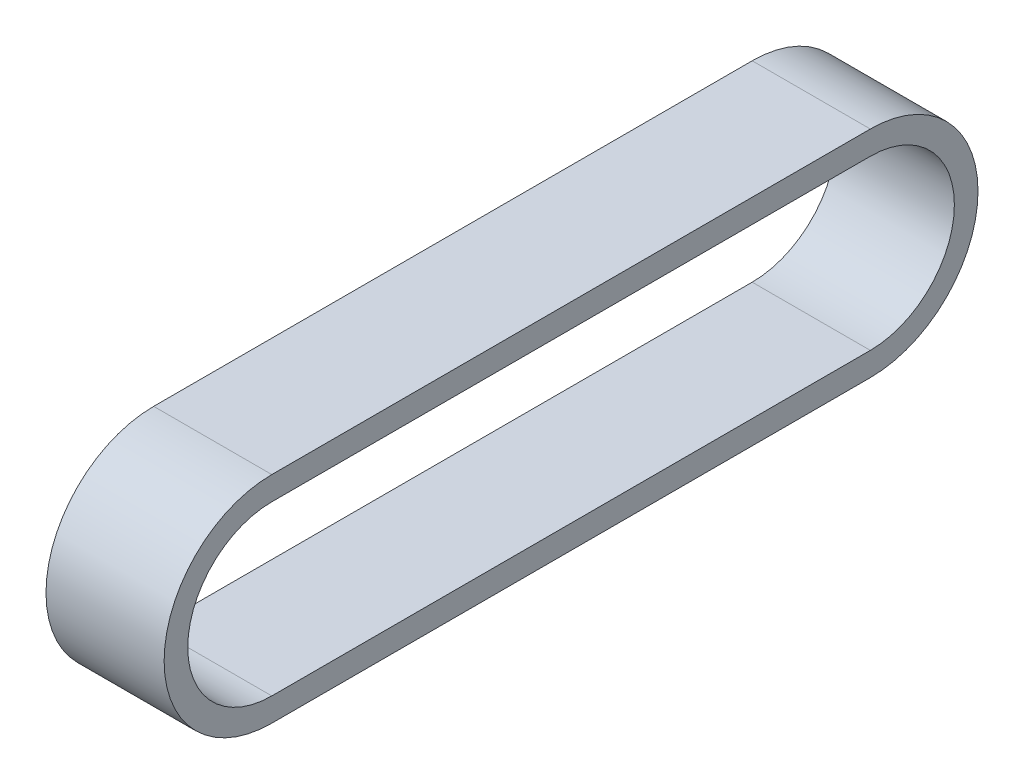
ISO-10303-21;
HEADER;
FILE_DESCRIPTION(('STEP AP214'),'2;1');
FILE_NAME('part.step','',(''),(''),'','','');
FILE_SCHEMA(('AUTOMOTIVE_DESIGN { 1 0 10303 214 1 1 1 1 }'));
ENDSEC;
DATA;
#1=APPLICATION_CONTEXT('core data for automotive mechanical design processes');
#2=APPLICATION_PROTOCOL_DEFINITION('international standard','automotive_design',2000,#1);
#3=PRODUCT_CONTEXT('',#1,'mechanical');
#4=PRODUCT('Part','Part','',(#3));
#5=PRODUCT_RELATED_PRODUCT_CATEGORY('part','',(#4));
#6=PRODUCT_DEFINITION_FORMATION('','',#4);
#7=PRODUCT_DEFINITION_CONTEXT('part definition',#1,'design');
#8=PRODUCT_DEFINITION('design','',#6,#7);
#9=PRODUCT_DEFINITION_SHAPE('','',#8);
#10=(LENGTH_UNIT() NAMED_UNIT(*) SI_UNIT(.MILLI.,.METRE.));
#11=(NAMED_UNIT(*) PLANE_ANGLE_UNIT() SI_UNIT($,.RADIAN.));
#12=(NAMED_UNIT(*) SI_UNIT($,.STERADIAN.) SOLID_ANGLE_UNIT());
#13=UNCERTAINTY_MEASURE_WITH_UNIT(LENGTH_MEASURE(1.E-05),#10,'distance_accuracy_value','');
#14=(GEOMETRIC_REPRESENTATION_CONTEXT(3) GLOBAL_UNCERTAINTY_ASSIGNED_CONTEXT((#13)) GLOBAL_UNIT_ASSIGNED_CONTEXT((#10,
#11,#12)) REPRESENTATION_CONTEXT('',''));
#15=CARTESIAN_POINT('',(0.,0.,0.));
#16=DIRECTION('',(0.,0.,1.));
#17=DIRECTION('',(1.,0.,0.));
#18=AXIS2_PLACEMENT_3D('',#15,#16,#17);
#19=CARTESIAN_POINT('',(-15.,0.,75.9999999999967));
#20=DIRECTION('',(1.,0.,0.));
#21=DIRECTION('',(0.,0.,-1.));
#22=AXIS2_PLACEMENT_3D('',#19,#20,#21);
#23=CYLINDRICAL_SURFACE('',#22,27.345);
#24=DIRECTION('',(1.,0.,0.));
#25=VECTOR('',#24,1.);
#26=CARTESIAN_POINT('',(-15.,-27.345,76.));
#27=LINE('',#26,#25);
#28=CARTESIAN_POINT('',(-15.,-27.345,76.));
#29=VERTEX_POINT('',#28);
#30=CARTESIAN_POINT('',(15.,-27.345,76.));
#31=VERTEX_POINT('',#30);
#32=EDGE_CURVE('E35',#29,#31,#27,.T.);
#33=ORIENTED_EDGE('',*,*,#32,.T.);
#34=CARTESIAN_POINT('',(15.,0.,75.9999999999967));
#35=DIRECTION('',(1.,0.,0.));
#36=DIRECTION('',(0.,0.,-1.));
#37=AXIS2_PLACEMENT_3D('',#34,#35,#36);
#38=CIRCLE('',#37,27.345);
#39=CARTESIAN_POINT('',(15.,27.345,76.));
#40=VERTEX_POINT('',#39);
#41=EDGE_CURVE('E130',#40,#31,#38,.T.);
#42=ORIENTED_EDGE('',*,*,#41,.F.);
#43=DIRECTION('',(1.,0.,0.));
#44=VECTOR('',#43,1.);
#45=CARTESIAN_POINT('',(-15.,27.345,76.));
#46=LINE('',#45,#44);
#47=CARTESIAN_POINT('',(-15.,27.345,76.));
#48=VERTEX_POINT('',#47);
#49=EDGE_CURVE('E11',#48,#40,#46,.T.);
#50=ORIENTED_EDGE('',*,*,#49,.F.);
#51=CARTESIAN_POINT('',(-15.,0.,75.9999999999967));
#52=DIRECTION('',(1.,0.,0.));
#53=DIRECTION('',(0.,0.,-1.));
#54=AXIS2_PLACEMENT_3D('',#51,#52,#53);
#55=CIRCLE('',#54,27.345);
#56=EDGE_CURVE('E145',#48,#29,#55,.T.);
#57=ORIENTED_EDGE('',*,*,#56,.T.);
#58=EDGE_LOOP('',(#33,#42,#50,#57));
#59=FACE_BOUND('',#58,.T.);
#60=ADVANCED_FACE('F32',(#59),#23,.T.);
#61=CARTESIAN_POINT('',(-15.,27.345,76.));
#62=DIRECTION('',(0.,1.,0.));
#63=DIRECTION('',(0.,0.,1.));
#64=AXIS2_PLACEMENT_3D('',#61,#62,#63);
#65=PLANE('',#64);
#66=ORIENTED_EDGE('',*,*,#49,.T.);
#67=DIRECTION('',(0.,0.,1.));
#68=VECTOR('',#67,1.);
#69=CARTESIAN_POINT('',(15.,27.345,76.));
#70=LINE('',#69,#68);
#71=CARTESIAN_POINT('',(15.,27.345,-76.));
#72=VERTEX_POINT('',#71);
#73=EDGE_CURVE('E142',#72,#40,#70,.T.);
#74=ORIENTED_EDGE('',*,*,#73,.F.);
#75=DIRECTION('',(1.,0.,0.));
#76=VECTOR('',#75,1.);
#77=CARTESIAN_POINT('',(-15.,27.345,-76.));
#78=LINE('',#77,#76);
#79=CARTESIAN_POINT('',(-15.,27.345,-76.));
#80=VERTEX_POINT('',#79);
#81=EDGE_CURVE('E40',#80,#72,#78,.T.);
#82=ORIENTED_EDGE('',*,*,#81,.F.);
#83=DIRECTION('',(0.,0.,1.));
#84=VECTOR('',#83,1.);
#85=CARTESIAN_POINT('',(-15.,27.345,76.));
#86=LINE('',#85,#84);
#87=EDGE_CURVE('E154',#80,#48,#86,.T.);
#88=ORIENTED_EDGE('',*,*,#87,.T.);
#89=EDGE_LOOP('',(#66,#74,#82,#88));
#90=FACE_BOUND('',#89,.T.);
#91=ADVANCED_FACE('F170',(#90),#65,.T.);
#92=CARTESIAN_POINT('',(-15.,0.,-75.9999999999967));
#93=DIRECTION('',(1.,0.,0.));
#94=DIRECTION('',(0.,0.,-1.));
#95=AXIS2_PLACEMENT_3D('',#92,#93,#94);
#96=CYLINDRICAL_SURFACE('',#95,27.345);
#97=ORIENTED_EDGE('',*,*,#81,.T.);
#98=CARTESIAN_POINT('',(15.,0.,-75.9999999999967));
#99=DIRECTION('',(1.,0.,0.));
#100=DIRECTION('',(0.,0.,-1.));
#101=AXIS2_PLACEMENT_3D('',#98,#99,#100);
#102=CIRCLE('',#101,27.345);
#103=CARTESIAN_POINT('',(15.,-27.345,-76.));
#104=VERTEX_POINT('',#103);
#105=EDGE_CURVE('E139',#104,#72,#102,.T.);
#106=ORIENTED_EDGE('',*,*,#105,.F.);
#107=DIRECTION('',(1.,0.,0.));
#108=VECTOR('',#107,1.);
#109=CARTESIAN_POINT('',(-15.,-27.345,-76.));
#110=LINE('',#109,#108);
#111=CARTESIAN_POINT('',(-15.,-27.345,-76.));
#112=VERTEX_POINT('',#111);
#113=EDGE_CURVE('E157',#112,#104,#110,.T.);
#114=ORIENTED_EDGE('',*,*,#113,.F.);
#115=CARTESIAN_POINT('',(-15.,0.,-75.9999999999967));
#116=DIRECTION('',(1.,0.,0.));
#117=DIRECTION('',(0.,0.,-1.));
#118=AXIS2_PLACEMENT_3D('',#115,#116,#117);
#119=CIRCLE('',#118,27.345);
#120=EDGE_CURVE('E151',#112,#80,#119,.T.);
#121=ORIENTED_EDGE('',*,*,#120,.T.);
#122=EDGE_LOOP('',(#97,#106,#114,#121));
#123=FACE_BOUND('',#122,.T.);
#124=ADVANCED_FACE('F174',(#123),#96,.T.);
#125=CARTESIAN_POINT('',(-15.,-27.345,76.));
#126=DIRECTION('',(0.,-1.,0.));
#127=DIRECTION('',(0.,0.,-1.));
#128=AXIS2_PLACEMENT_3D('',#125,#126,#127);
#129=PLANE('',#128);
#130=ORIENTED_EDGE('',*,*,#113,.T.);
#131=DIRECTION('',(0.,0.,-1.));
#132=VECTOR('',#131,1.);
#133=CARTESIAN_POINT('',(15.,-27.345,76.));
#134=LINE('',#133,#132);
#135=EDGE_CURVE('E136',#31,#104,#134,.T.);
#136=ORIENTED_EDGE('',*,*,#135,.F.);
#137=ORIENTED_EDGE('',*,*,#32,.F.);
#138=DIRECTION('',(0.,0.,-1.));
#139=VECTOR('',#138,1.);
#140=CARTESIAN_POINT('',(-15.,-27.345,76.));
#141=LINE('',#140,#139);
#142=EDGE_CURVE('E148',#29,#112,#141,.T.);
#143=ORIENTED_EDGE('',*,*,#142,.T.);
#144=EDGE_LOOP('',(#130,#136,#137,#143));
#145=FACE_BOUND('',#144,.T.);
#146=ADVANCED_FACE('F164',(#145),#129,.T.);
#147=CARTESIAN_POINT('',(-15.,0.,75.9999999999967));
#148=DIRECTION('',(1.,0.,0.));
#149=DIRECTION('',(0.,0.,-1.));
#150=AXIS2_PLACEMENT_3D('',#147,#148,#149);
#151=PLANE('',#150);
#152=DIRECTION('',(0.,0.,1.));
#153=VECTOR('',#152,1.);
#154=CARTESIAN_POINT('',(-15.,21.345,75.9999999999951));
#155=LINE('',#154,#153);
#156=CARTESIAN_POINT('',(-15.,21.3450000000002,-75.9999999999951));
#157=VERTEX_POINT('',#156);
#158=CARTESIAN_POINT('',(-15.,21.345,75.9999999999951));
#159=VERTEX_POINT('',#158);
#160=EDGE_CURVE('E105',#157,#159,#155,.T.);
#161=ORIENTED_EDGE('',*,*,#160,.T.);
#162=CARTESIAN_POINT('',(-15.,0.,75.9999999999951));
#163=DIRECTION('',(1.,0.,0.));
#164=DIRECTION('',(0.,0.,-1.));
#165=AXIS2_PLACEMENT_3D('',#162,#163,#164);
#166=CIRCLE('',#165,21.345);
#167=CARTESIAN_POINT('',(-15.,-21.345,75.9999999999951));
#168=VERTEX_POINT('',#167);
#169=EDGE_CURVE('E99',#159,#168,#166,.T.);
#170=ORIENTED_EDGE('',*,*,#169,.T.);
#171=DIRECTION('',(0.,0.,-1.));
#172=VECTOR('',#171,1.);
#173=CARTESIAN_POINT('',(-15.,-21.345,75.9999999999951));
#174=LINE('',#173,#172);
#175=CARTESIAN_POINT('',(-15.,-21.3450000000002,-75.999999999995));
#176=VERTEX_POINT('',#175);
#177=EDGE_CURVE('E108',#168,#176,#174,.T.);
#178=ORIENTED_EDGE('',*,*,#177,.T.);
#179=CARTESIAN_POINT('',(-15.,0.,-75.9999999999951));
#180=DIRECTION('',(1.,0.,0.));
#181=DIRECTION('',(0.,0.,-1.));
#182=AXIS2_PLACEMENT_3D('',#179,#180,#181);
#183=CIRCLE('',#182,21.3450000000002);
#184=EDGE_CURVE('E48',#176,#157,#183,.T.);
#185=ORIENTED_EDGE('',*,*,#184,.T.);
#186=EDGE_LOOP('',(#161,#170,#178,#185));
#187=FACE_BOUND('',#186,.T.);
#188=ORIENTED_EDGE('',*,*,#56,.F.);
#189=ORIENTED_EDGE('',*,*,#87,.F.);
#190=ORIENTED_EDGE('',*,*,#120,.F.);
#191=ORIENTED_EDGE('',*,*,#142,.F.);
#192=EDGE_LOOP('',(#188,#189,#190,#191));
#193=FACE_BOUND('',#192,.T.);
#194=ADVANCED_FACE('F112',(#187,#193),#151,.F.);
#195=CARTESIAN_POINT('',(15.,0.,75.9999999999967));
#196=DIRECTION('',(1.,0.,0.));
#197=DIRECTION('',(0.,0.,-1.));
#198=AXIS2_PLACEMENT_3D('',#195,#196,#197);
#199=PLANE('',#198);
#200=CARTESIAN_POINT('',(15.,0.,75.9999999999951));
#201=DIRECTION('',(1.,0.,0.));
#202=DIRECTION('',(0.,0.,-1.));
#203=AXIS2_PLACEMENT_3D('',#200,#201,#202);
#204=CIRCLE('',#203,21.345);
#205=CARTESIAN_POINT('',(15.,21.345,75.9999999999951));
#206=VERTEX_POINT('',#205);
#207=CARTESIAN_POINT('',(15.,-21.345,75.9999999999951));
#208=VERTEX_POINT('',#207);
#209=EDGE_CURVE('E56',#206,#208,#204,.T.);
#210=ORIENTED_EDGE('',*,*,#209,.F.);
#211=DIRECTION('',(0.,0.,1.));
#212=VECTOR('',#211,1.);
#213=CARTESIAN_POINT('',(15.,21.345,75.9999999999951));
#214=LINE('',#213,#212);
#215=CARTESIAN_POINT('',(15.,21.3450000000002,-75.9999999999951));
#216=VERTEX_POINT('',#215);
#217=EDGE_CURVE('E115',#216,#206,#214,.T.);
#218=ORIENTED_EDGE('',*,*,#217,.F.);
#219=CARTESIAN_POINT('',(15.,0.,-75.9999999999951));
#220=DIRECTION('',(1.,0.,0.));
#221=DIRECTION('',(0.,0.,-1.));
#222=AXIS2_PLACEMENT_3D('',#219,#220,#221);
#223=CIRCLE('',#222,21.3450000000002);
#224=CARTESIAN_POINT('',(15.,-21.3450000000002,-75.9999999999951));
#225=VERTEX_POINT('',#224);
#226=EDGE_CURVE('E118',#225,#216,#223,.T.);
#227=ORIENTED_EDGE('',*,*,#226,.F.);
#228=DIRECTION('',(0.,0.,-1.));
#229=VECTOR('',#228,1.);
#230=CARTESIAN_POINT('',(15.,-21.345,75.9999999999951));
#231=LINE('',#230,#229);
#232=EDGE_CURVE('E124',#208,#225,#231,.T.);
#233=ORIENTED_EDGE('',*,*,#232,.F.);
#234=EDGE_LOOP('',(#210,#218,#227,#233));
#235=FACE_BOUND('',#234,.T.);
#236=ORIENTED_EDGE('',*,*,#41,.T.);
#237=ORIENTED_EDGE('',*,*,#135,.T.);
#238=ORIENTED_EDGE('',*,*,#105,.T.);
#239=ORIENTED_EDGE('',*,*,#73,.T.);
#240=EDGE_LOOP('',(#236,#237,#238,#239));
#241=FACE_BOUND('',#240,.T.);
#242=ADVANCED_FACE('F167',(#235,#241),#199,.T.);
#243=CARTESIAN_POINT('',(-15.,0.,75.9999999999951));
#244=DIRECTION('',(1.,0.,0.));
#245=DIRECTION('',(0.,0.,-1.));
#246=AXIS2_PLACEMENT_3D('',#243,#244,#245);
#247=CYLINDRICAL_SURFACE('',#246,21.345);
#248=ORIENTED_EDGE('',*,*,#209,.T.);
#249=DIRECTION('',(1.,0.,0.));
#250=VECTOR('',#249,1.);
#251=CARTESIAN_POINT('',(-15.,-21.345,75.9999999999951));
#252=LINE('',#251,#250);
#253=EDGE_CURVE('E95',#168,#208,#252,.T.);
#254=ORIENTED_EDGE('',*,*,#253,.F.);
#255=ORIENTED_EDGE('',*,*,#169,.F.);
#256=DIRECTION('',(1.,0.,0.));
#257=VECTOR('',#256,1.);
#258=CARTESIAN_POINT('',(-15.,21.345,75.9999999999951));
#259=LINE('',#258,#257);
#260=EDGE_CURVE('E128',#159,#206,#259,.T.);
#261=ORIENTED_EDGE('',*,*,#260,.T.);
#262=EDGE_LOOP('',(#248,#254,#255,#261));
#263=FACE_BOUND('',#262,.T.);
#264=ADVANCED_FACE('F97',(#263),#247,.F.);
#265=CARTESIAN_POINT('',(-15.,21.345,75.9999999999951));
#266=DIRECTION('',(0.,1.,0.));
#267=DIRECTION('',(0.,0.,1.));
#268=AXIS2_PLACEMENT_3D('',#265,#266,#267);
#269=PLANE('',#268);
#270=ORIENTED_EDGE('',*,*,#217,.T.);
#271=ORIENTED_EDGE('',*,*,#260,.F.);
#272=ORIENTED_EDGE('',*,*,#160,.F.);
#273=DIRECTION('',(1.,0.,0.));
#274=VECTOR('',#273,1.);
#275=CARTESIAN_POINT('',(-15.,21.3450000000002,-75.9999999999951));
#276=LINE('',#275,#274);
#277=EDGE_CURVE('E131',#157,#216,#276,.T.);
#278=ORIENTED_EDGE('',*,*,#277,.T.);
#279=EDGE_LOOP('',(#270,#271,#272,#278));
#280=FACE_BOUND('',#279,.T.);
#281=ADVANCED_FACE('F225',(#280),#269,.F.);
#282=CARTESIAN_POINT('',(-15.,0.,-75.9999999999951));
#283=DIRECTION('',(1.,0.,0.));
#284=DIRECTION('',(0.,0.,-1.));
#285=AXIS2_PLACEMENT_3D('',#282,#283,#284);
#286=CYLINDRICAL_SURFACE('',#285,21.3450000000002);
#287=ORIENTED_EDGE('',*,*,#226,.T.);
#288=ORIENTED_EDGE('',*,*,#277,.F.);
#289=ORIENTED_EDGE('',*,*,#184,.F.);
#290=DIRECTION('',(1.,0.,0.));
#291=VECTOR('',#290,1.);
#292=CARTESIAN_POINT('',(-15.,-21.3450000000002,-75.9999999999951));
#293=LINE('',#292,#291);
#294=EDGE_CURVE('E104',#176,#225,#293,.T.);
#295=ORIENTED_EDGE('',*,*,#294,.T.);
#296=EDGE_LOOP('',(#287,#288,#289,#295));
#297=FACE_BOUND('',#296,.T.);
#298=ADVANCED_FACE('F234',(#297),#286,.F.);
#299=CARTESIAN_POINT('',(-15.,-21.345,75.9999999999951));
#300=DIRECTION('',(0.,-1.,0.));
#301=DIRECTION('',(0.,0.,-1.));
#302=AXIS2_PLACEMENT_3D('',#299,#300,#301);
#303=PLANE('',#302);
#304=ORIENTED_EDGE('',*,*,#232,.T.);
#305=ORIENTED_EDGE('',*,*,#294,.F.);
#306=ORIENTED_EDGE('',*,*,#177,.F.);
#307=ORIENTED_EDGE('',*,*,#253,.T.);
#308=EDGE_LOOP('',(#304,#305,#306,#307));
#309=FACE_BOUND('',#308,.T.);
#310=ADVANCED_FACE('F109',(#309),#303,.F.);
#311=CLOSED_SHELL('',(#60,#91,#124,#146,#194,#242,#264,#281,#298,#310));
#312=MANIFOLD_SOLID_BREP('B2',#311);
#313=ADVANCED_BREP_SHAPE_REPRESENTATION('',(#18,#312),#14);
#314=SHAPE_DEFINITION_REPRESENTATION(#9,#313);
ENDSEC;
END-ISO-10303-21;
